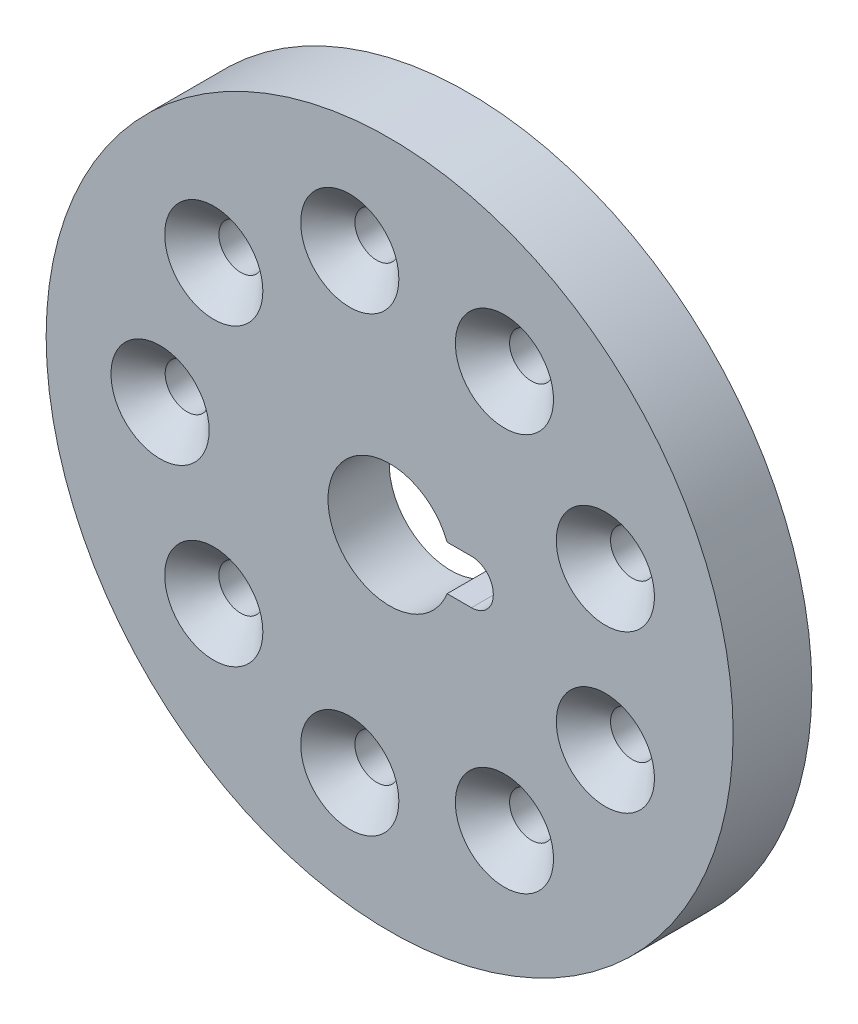
ISO-10303-21;
HEADER;
FILE_DESCRIPTION(('STEP AP214'),'2;1');
FILE_NAME('part.step','',(''),(''),'','','');
FILE_SCHEMA(('AUTOMOTIVE_DESIGN { 1 0 10303 214 1 1 1 1 }'));
ENDSEC;
DATA;
#1=APPLICATION_CONTEXT('core data for automotive mechanical design processes');
#2=APPLICATION_PROTOCOL_DEFINITION('international standard','automotive_design',2000,#1);
#3=PRODUCT_CONTEXT('',#1,'mechanical');
#4=PRODUCT('Part','Part','',(#3));
#5=PRODUCT_RELATED_PRODUCT_CATEGORY('part','',(#4));
#6=PRODUCT_DEFINITION_FORMATION('','',#4);
#7=PRODUCT_DEFINITION_CONTEXT('part definition',#1,'design');
#8=PRODUCT_DEFINITION('design','',#6,#7);
#9=PRODUCT_DEFINITION_SHAPE('','',#8);
#10=(LENGTH_UNIT() NAMED_UNIT(*) SI_UNIT(.MILLI.,.METRE.));
#11=(NAMED_UNIT(*) PLANE_ANGLE_UNIT() SI_UNIT($,.RADIAN.));
#12=(NAMED_UNIT(*) SI_UNIT($,.STERADIAN.) SOLID_ANGLE_UNIT());
#13=UNCERTAINTY_MEASURE_WITH_UNIT(LENGTH_MEASURE(1.E-05),#10,'distance_accuracy_value','');
#14=(GEOMETRIC_REPRESENTATION_CONTEXT(3) GLOBAL_UNCERTAINTY_ASSIGNED_CONTEXT((#13)) GLOBAL_UNIT_ASSIGNED_CONTEXT((#10,
#11,#12)) REPRESENTATION_CONTEXT('',''));
#15=CARTESIAN_POINT('',(0.,0.,0.));
#16=DIRECTION('',(0.,0.,1.));
#17=DIRECTION('',(1.,0.,0.));
#18=AXIS2_PLACEMENT_3D('',#15,#16,#17);
#19=CARTESIAN_POINT('',(-26.2463047854721,8.30206785474665E-11,5.9));
#20=DIRECTION('',(0.,0.,1.));
#21=DIRECTION('',(1.,0.,0.));
#22=AXIS2_PLACEMENT_3D('',#19,#20,#21);
#23=CONICAL_SURFACE('',#22,2.5125,0.785398163397448);
#24=CARTESIAN_POINT('',(-26.2463047854721,8.30206785474665E-11,5.9));
#25=DIRECTION('',(0.,0.,1.));
#26=DIRECTION('',(1.,0.,0.));
#27=AXIS2_PLACEMENT_3D('',#24,#25,#26);
#28=CIRCLE('',#27,2.5125);
#29=CARTESIAN_POINT('',(-23.7338047854721,8.30206785474665E-11,5.9));
#30=VERTEX_POINT('',#29);
#31=EDGE_CURVE('E301',#30,#30,#28,.T.);
#32=ORIENTED_EDGE('',*,*,#31,.F.);
#33=EDGE_LOOP('',(#32));
#34=FACE_BOUND('',#33,.T.);
#35=CARTESIAN_POINT('',(-26.2463047854721,8.30206785474665E-11,9.));
#36=DIRECTION('',(0.,0.,-1.));
#37=DIRECTION('',(1.,0.,0.));
#38=AXIS2_PLACEMENT_3D('',#35,#36,#37);
#39=CIRCLE('',#38,5.6125);
#40=CARTESIAN_POINT('',(-20.6338047854721,8.30206785474665E-11,9.));
#41=VERTEX_POINT('',#40);
#42=EDGE_CURVE('E250',#41,#41,#39,.T.);
#43=ORIENTED_EDGE('',*,*,#42,.F.);
#44=EDGE_LOOP('',(#43));
#45=FACE_BOUND('',#44,.T.);
#46=ADVANCED_FACE('F16',(#34,#45),#23,.F.);
#47=CARTESIAN_POINT('',(-20.1049714173453,-16.8731747541887,5.9));
#48=DIRECTION('',(0.,0.,1.));
#49=DIRECTION('',(1.,0.,0.));
#50=AXIS2_PLACEMENT_3D('',#47,#48,#49);
#51=CONICAL_SURFACE('',#50,2.5125,0.785398163397448);
#52=CARTESIAN_POINT('',(-20.1049714173453,-16.8731747541887,5.9));
#53=DIRECTION('',(0.,0.,1.));
#54=DIRECTION('',(1.,0.,0.));
#55=AXIS2_PLACEMENT_3D('',#52,#53,#54);
#56=CIRCLE('',#55,2.5125);
#57=CARTESIAN_POINT('',(-17.5924714173453,-16.8731747541887,5.9));
#58=VERTEX_POINT('',#57);
#59=EDGE_CURVE('E341',#58,#58,#56,.T.);
#60=ORIENTED_EDGE('',*,*,#59,.F.);
#61=EDGE_LOOP('',(#60));
#62=FACE_BOUND('',#61,.T.);
#63=CARTESIAN_POINT('',(-20.1049714173453,-16.8731747541887,9.));
#64=DIRECTION('',(0.,0.,-1.));
#65=DIRECTION('',(1.,0.,0.));
#66=AXIS2_PLACEMENT_3D('',#63,#64,#65);
#67=CIRCLE('',#66,5.6125);
#68=CARTESIAN_POINT('',(-14.4924714173453,-16.8731747541887,9.));
#69=VERTEX_POINT('',#68);
#70=EDGE_CURVE('E253',#69,#69,#67,.T.);
#71=ORIENTED_EDGE('',*,*,#70,.F.);
#72=EDGE_LOOP('',(#71));
#73=FACE_BOUND('',#72,.T.);
#74=ADVANCED_FACE('F390',(#62,#73),#51,.F.);
#75=CARTESIAN_POINT('',(-20.1049714173452,16.8731747543547,5.9));
#76=DIRECTION('',(0.,0.,1.));
#77=DIRECTION('',(1.,0.,0.));
#78=AXIS2_PLACEMENT_3D('',#75,#76,#77);
#79=CONICAL_SURFACE('',#78,2.5125,0.785398163397448);
#80=CARTESIAN_POINT('',(-20.1049714173452,16.8731747543547,5.9));
#81=DIRECTION('',(0.,0.,1.));
#82=DIRECTION('',(1.,0.,0.));
#83=AXIS2_PLACEMENT_3D('',#80,#81,#82);
#84=CIRCLE('',#83,2.5125);
#85=CARTESIAN_POINT('',(-17.5924714173452,16.8731747543547,5.9));
#86=VERTEX_POINT('',#85);
#87=EDGE_CURVE('E231',#86,#86,#84,.T.);
#88=ORIENTED_EDGE('',*,*,#87,.F.);
#89=EDGE_LOOP('',(#88));
#90=FACE_BOUND('',#89,.T.);
#91=CARTESIAN_POINT('',(-20.1049714173452,16.8731747543547,9.));
#92=DIRECTION('',(0.,0.,-1.));
#93=DIRECTION('',(1.,0.,0.));
#94=AXIS2_PLACEMENT_3D('',#91,#92,#93);
#95=CIRCLE('',#94,5.6125);
#96=CARTESIAN_POINT('',(-14.4924714173452,16.8731747543547,9.));
#97=VERTEX_POINT('',#96);
#98=EDGE_CURVE('E263',#97,#97,#95,.T.);
#99=ORIENTED_EDGE('',*,*,#98,.F.);
#100=EDGE_LOOP('',(#99));
#101=FACE_BOUND('',#100,.T.);
#102=ADVANCED_FACE('F395',(#90,#101),#79,.F.);
#103=CARTESIAN_POINT('',(-4.55456944922891,25.8512035166534,5.9));
#104=DIRECTION('',(0.,0.,1.));
#105=DIRECTION('',(1.,0.,0.));
#106=AXIS2_PLACEMENT_3D('',#103,#104,#105);
#107=CONICAL_SURFACE('',#106,2.5125,0.785398163397448);
#108=CARTESIAN_POINT('',(-4.55456944922891,25.8512035166534,5.9));
#109=DIRECTION('',(0.,0.,1.));
#110=DIRECTION('',(1.,0.,0.));
#111=AXIS2_PLACEMENT_3D('',#108,#109,#110);
#112=CIRCLE('',#111,2.5125);
#113=CARTESIAN_POINT('',(-2.04206944922891,25.8512035166534,5.9));
#114=VERTEX_POINT('',#113);
#115=EDGE_CURVE('E232',#114,#114,#112,.T.);
#116=ORIENTED_EDGE('',*,*,#115,.F.);
#117=EDGE_LOOP('',(#116));
#118=FACE_BOUND('',#117,.T.);
#119=CARTESIAN_POINT('',(-4.55456944922891,25.8512035166534,9.));
#120=DIRECTION('',(0.,0.,-1.));
#121=DIRECTION('',(1.,0.,0.));
#122=AXIS2_PLACEMENT_3D('',#119,#120,#121);
#123=CIRCLE('',#122,5.6125);
#124=CARTESIAN_POINT('',(1.05793055077109,25.8512035166534,9.));
#125=VERTEX_POINT('',#124);
#126=EDGE_CURVE('E259',#125,#125,#123,.T.);
#127=ORIENTED_EDGE('',*,*,#126,.F.);
#128=EDGE_LOOP('',(#127));
#129=FACE_BOUND('',#128,.T.);
#130=ADVANCED_FACE('F548',(#118,#129),#107,.F.);
#131=CARTESIAN_POINT('',(24.6706265101581,8.97802876238172,5.9));
#132=DIRECTION('',(0.,0.,1.));
#133=DIRECTION('',(1.,0.,0.));
#134=AXIS2_PLACEMENT_3D('',#131,#132,#133);
#135=CONICAL_SURFACE('',#134,2.5125,0.785398163397448);
#136=CARTESIAN_POINT('',(24.6706265101581,8.97802876238172,5.9));
#137=DIRECTION('',(0.,0.,1.));
#138=DIRECTION('',(1.,0.,0.));
#139=AXIS2_PLACEMENT_3D('',#136,#137,#138);
#140=CIRCLE('',#139,2.5125);
#141=CARTESIAN_POINT('',(27.1831265101581,8.97802876238172,5.9));
#142=VERTEX_POINT('',#141);
#143=EDGE_CURVE('E202',#142,#142,#140,.T.);
#144=ORIENTED_EDGE('',*,*,#143,.F.);
#145=EDGE_LOOP('',(#144));
#146=FACE_BOUND('',#145,.T.);
#147=CARTESIAN_POINT('',(24.6706265101581,8.97802876238172,9.));
#148=DIRECTION('',(0.,0.,-1.));
#149=DIRECTION('',(1.,0.,0.));
#150=AXIS2_PLACEMENT_3D('',#147,#148,#149);
#151=CIRCLE('',#150,5.6125);
#152=CARTESIAN_POINT('',(30.2831265101581,8.97802876238172,9.));
#153=VERTEX_POINT('',#152);
#154=EDGE_CURVE('E262',#153,#153,#151,.T.);
#155=ORIENTED_EDGE('',*,*,#154,.F.);
#156=EDGE_LOOP('',(#155));
#157=FACE_BOUND('',#156,.T.);
#158=ADVANCED_FACE('F625',(#146,#157),#135,.F.);
#159=CARTESIAN_POINT('',(13.1286952145279,-22.7331668492586,5.9));
#160=DIRECTION('',(0.,0.,1.));
#161=DIRECTION('',(1.,0.,0.));
#162=AXIS2_PLACEMENT_3D('',#159,#160,#161);
#163=CONICAL_SURFACE('',#162,2.5125,0.785398163397448);
#164=CARTESIAN_POINT('',(13.1286952145279,-22.7331668492586,5.9));
#165=DIRECTION('',(0.,0.,1.));
#166=DIRECTION('',(1.,0.,0.));
#167=AXIS2_PLACEMENT_3D('',#164,#165,#166);
#168=CIRCLE('',#167,2.5125);
#169=CARTESIAN_POINT('',(15.6411952145279,-22.7331668492586,5.9));
#170=VERTEX_POINT('',#169);
#171=EDGE_CURVE('E338',#170,#170,#168,.T.);
#172=ORIENTED_EDGE('',*,*,#171,.F.);
#173=EDGE_LOOP('',(#172));
#174=FACE_BOUND('',#173,.T.);
#175=CARTESIAN_POINT('',(13.1286952145279,-22.7331668492586,9.));
#176=DIRECTION('',(0.,0.,-1.));
#177=DIRECTION('',(1.,0.,0.));
#178=AXIS2_PLACEMENT_3D('',#175,#176,#177);
#179=CIRCLE('',#178,5.6125);
#180=CARTESIAN_POINT('',(18.7411952145279,-22.7331668492586,9.));
#181=VERTEX_POINT('',#180);
#182=EDGE_CURVE('E240',#181,#181,#179,.T.);
#183=ORIENTED_EDGE('',*,*,#182,.F.);
#184=EDGE_LOOP('',(#183));
#185=FACE_BOUND('',#184,.T.);
#186=ADVANCED_FACE('F621',(#174,#185),#163,.F.);
#187=CARTESIAN_POINT('',(-4.55456944922904,-25.8512035164876,5.9));
#188=DIRECTION('',(0.,0.,1.));
#189=DIRECTION('',(1.,0.,0.));
#190=AXIS2_PLACEMENT_3D('',#187,#188,#189);
#191=CONICAL_SURFACE('',#190,2.5125,0.785398163397448);
#192=CARTESIAN_POINT('',(-4.55456944922904,-25.8512035164876,5.9));
#193=DIRECTION('',(0.,0.,1.));
#194=DIRECTION('',(1.,0.,0.));
#195=AXIS2_PLACEMENT_3D('',#192,#193,#194);
#196=CIRCLE('',#195,2.5125);
#197=CARTESIAN_POINT('',(-2.04206944922904,-25.8512035164876,5.9));
#198=VERTEX_POINT('',#197);
#199=EDGE_CURVE('E328',#198,#198,#196,.T.);
#200=ORIENTED_EDGE('',*,*,#199,.F.);
#201=EDGE_LOOP('',(#200));
#202=FACE_BOUND('',#201,.T.);
#203=CARTESIAN_POINT('',(-4.55456944922904,-25.8512035164876,9.));
#204=DIRECTION('',(0.,0.,-1.));
#205=DIRECTION('',(1.,0.,0.));
#206=AXIS2_PLACEMENT_3D('',#203,#204,#205);
#207=CIRCLE('',#206,5.6125);
#208=CARTESIAN_POINT('',(1.05793055077096,-25.8512035164876,9.));
#209=VERTEX_POINT('',#208);
#210=EDGE_CURVE('E236',#209,#209,#207,.T.);
#211=ORIENTED_EDGE('',*,*,#210,.F.);
#212=EDGE_LOOP('',(#211));
#213=FACE_BOUND('',#212,.T.);
#214=ADVANCED_FACE('F430',(#202,#213),#191,.F.);
#215=CARTESIAN_POINT('',(24.6706265101581,-8.97802876221591,5.9));
#216=DIRECTION('',(0.,0.,1.));
#217=DIRECTION('',(1.,0.,0.));
#218=AXIS2_PLACEMENT_3D('',#215,#216,#217);
#219=CONICAL_SURFACE('',#218,2.5125,0.785398163397448);
#220=CARTESIAN_POINT('',(24.6706265101581,-8.97802876221591,5.9));
#221=DIRECTION('',(0.,0.,1.));
#222=DIRECTION('',(1.,0.,0.));
#223=AXIS2_PLACEMENT_3D('',#220,#221,#222);
#224=CIRCLE('',#223,2.5125);
#225=CARTESIAN_POINT('',(27.1831265101581,-8.97802876221591,5.9));
#226=VERTEX_POINT('',#225);
#227=EDGE_CURVE('E203',#226,#226,#224,.T.);
#228=ORIENTED_EDGE('',*,*,#227,.F.);
#229=EDGE_LOOP('',(#228));
#230=FACE_BOUND('',#229,.T.);
#231=CARTESIAN_POINT('',(24.6706265101581,-8.97802876221591,9.));
#232=DIRECTION('',(0.,0.,-1.));
#233=DIRECTION('',(1.,0.,0.));
#234=AXIS2_PLACEMENT_3D('',#231,#232,#233);
#235=CIRCLE('',#234,5.6125);
#236=CARTESIAN_POINT('',(30.2831265101581,-8.97802876221591,9.));
#237=VERTEX_POINT('',#236);
#238=EDGE_CURVE('E239',#237,#237,#235,.T.);
#239=ORIENTED_EDGE('',*,*,#238,.F.);
#240=EDGE_LOOP('',(#239));
#241=FACE_BOUND('',#240,.T.);
#242=ADVANCED_FACE('F427',(#230,#241),#219,.F.);
#243=CARTESIAN_POINT('',(13.128695214528,22.7331668494245,5.9));
#244=DIRECTION('',(0.,0.,1.));
#245=DIRECTION('',(1.,0.,0.));
#246=AXIS2_PLACEMENT_3D('',#243,#244,#245);
#247=CONICAL_SURFACE('',#246,2.5125,0.785398163397448);
#248=CARTESIAN_POINT('',(13.128695214528,22.7331668494245,5.9));
#249=DIRECTION('',(0.,0.,1.));
#250=DIRECTION('',(1.,0.,0.));
#251=AXIS2_PLACEMENT_3D('',#248,#249,#250);
#252=CIRCLE('',#251,2.5125);
#253=CARTESIAN_POINT('',(15.641195214528,22.7331668494245,5.9));
#254=VERTEX_POINT('',#253);
#255=EDGE_CURVE('E246',#254,#254,#252,.T.);
#256=ORIENTED_EDGE('',*,*,#255,.F.);
#257=EDGE_LOOP('',(#256));
#258=FACE_BOUND('',#257,.T.);
#259=CARTESIAN_POINT('',(13.128695214528,22.7331668494245,9.));
#260=DIRECTION('',(0.,0.,-1.));
#261=DIRECTION('',(1.,0.,0.));
#262=AXIS2_PLACEMENT_3D('',#259,#260,#261);
#263=CIRCLE('',#262,5.6125);
#264=CARTESIAN_POINT('',(18.741195214528,22.7331668494245,9.));
#265=VERTEX_POINT('',#264);
#266=EDGE_CURVE('E326',#265,#265,#263,.T.);
#267=ORIENTED_EDGE('',*,*,#266,.F.);
#268=EDGE_LOOP('',(#267));
#269=FACE_BOUND('',#268,.T.);
#270=ADVANCED_FACE('F385',(#258,#269),#247,.F.);
#271=CARTESIAN_POINT('',(0.00369521452794896,8.29614155151148E-11,2.));
#272=DIRECTION('',(0.,0.,1.));
#273=DIRECTION('',(1.,0.,0.));
#274=AXIS2_PLACEMENT_3D('',#271,#272,#273);
#275=PLANE('',#274);
#276=CARTESIAN_POINT('',(0.00369521452792121,8.30243805016595E-11,2.));
#277=DIRECTION('',(0.,0.,1.));
#278=DIRECTION('',(1.,0.,0.));
#279=AXIS2_PLACEMENT_3D('',#276,#277,#278);
#280=CIRCLE('',#279,32.56);
#281=CARTESIAN_POINT('',(32.5636952145279,8.30243805016595E-11,2.));
#282=VERTEX_POINT('',#281);
#283=EDGE_CURVE('E11',#282,#282,#280,.T.);
#284=ORIENTED_EDGE('',*,*,#283,.F.);
#285=EDGE_LOOP('',(#284));
#286=FACE_BOUND('',#285,.T.);
#287=CARTESIAN_POINT('',(-26.2463047854721,8.30206785474665E-11,2.));
#288=DIRECTION('',(0.,0.,1.));
#289=DIRECTION('',(1.,0.,0.));
#290=AXIS2_PLACEMENT_3D('',#287,#288,#289);
#291=CIRCLE('',#290,2.5125);
#292=CARTESIAN_POINT('',(-23.7338047854721,8.30206785474665E-11,2.));
#293=VERTEX_POINT('',#292);
#294=EDGE_CURVE('E235',#293,#293,#291,.T.);
#295=ORIENTED_EDGE('',*,*,#294,.T.);
#296=EDGE_LOOP('',(#295));
#297=FACE_BOUND('',#296,.T.);
#298=CARTESIAN_POINT('',(-20.1049714173453,-16.8731747541887,2.));
#299=DIRECTION('',(0.,0.,1.));
#300=DIRECTION('',(1.,0.,0.));
#301=AXIS2_PLACEMENT_3D('',#298,#299,#300);
#302=CIRCLE('',#301,2.5125);
#303=CARTESIAN_POINT('',(-17.5924714173453,-16.8731747541887,2.));
#304=VERTEX_POINT('',#303);
#305=EDGE_CURVE('E348',#304,#304,#302,.T.);
#306=ORIENTED_EDGE('',*,*,#305,.T.);
#307=EDGE_LOOP('',(#306));
#308=FACE_BOUND('',#307,.T.);
#309=CARTESIAN_POINT('',(-4.55456944922904,-25.8512035164876,2.));
#310=DIRECTION('',(0.,0.,1.));
#311=DIRECTION('',(1.,0.,0.));
#312=AXIS2_PLACEMENT_3D('',#309,#310,#311);
#313=CIRCLE('',#312,2.5125);
#314=CARTESIAN_POINT('',(-2.04206944922904,-25.8512035164876,2.));
#315=VERTEX_POINT('',#314);
#316=EDGE_CURVE('E331',#315,#315,#313,.T.);
#317=ORIENTED_EDGE('',*,*,#316,.T.);
#318=EDGE_LOOP('',(#317));
#319=FACE_BOUND('',#318,.T.);
#320=CARTESIAN_POINT('',(13.1286952145279,-22.7331668492586,2.));
#321=DIRECTION('',(0.,0.,1.));
#322=DIRECTION('',(1.,0.,0.));
#323=AXIS2_PLACEMENT_3D('',#320,#321,#322);
#324=CIRCLE('',#323,2.5125);
#325=CARTESIAN_POINT('',(15.6411952145279,-22.7331668492586,2.));
#326=VERTEX_POINT('',#325);
#327=EDGE_CURVE('E330',#326,#326,#324,.T.);
#328=ORIENTED_EDGE('',*,*,#327,.T.);
#329=EDGE_LOOP('',(#328));
#330=FACE_BOUND('',#329,.T.);
#331=CARTESIAN_POINT('',(24.6706265101581,-8.97802876221591,2.));
#332=DIRECTION('',(0.,0.,1.));
#333=DIRECTION('',(1.,0.,0.));
#334=AXIS2_PLACEMENT_3D('',#331,#332,#333);
#335=CIRCLE('',#334,2.5125);
#336=CARTESIAN_POINT('',(27.1831265101581,-8.97802876221591,2.));
#337=VERTEX_POINT('',#336);
#338=EDGE_CURVE('E212',#337,#337,#335,.T.);
#339=ORIENTED_EDGE('',*,*,#338,.T.);
#340=EDGE_LOOP('',(#339));
#341=FACE_BOUND('',#340,.T.);
#342=CARTESIAN_POINT('',(24.6706265101581,8.97802876238172,2.));
#343=DIRECTION('',(0.,0.,1.));
#344=DIRECTION('',(1.,0.,0.));
#345=AXIS2_PLACEMENT_3D('',#342,#343,#344);
#346=CIRCLE('',#345,2.5125);
#347=CARTESIAN_POINT('',(27.1831265101581,8.97802876238172,2.));
#348=VERTEX_POINT('',#347);
#349=EDGE_CURVE('E197',#348,#348,#346,.T.);
#350=ORIENTED_EDGE('',*,*,#349,.T.);
#351=EDGE_LOOP('',(#350));
#352=FACE_BOUND('',#351,.T.);
#353=CARTESIAN_POINT('',(13.128695214528,22.7331668494245,2.));
#354=DIRECTION('',(0.,0.,1.));
#355=DIRECTION('',(1.,0.,0.));
#356=AXIS2_PLACEMENT_3D('',#353,#354,#355);
#357=CIRCLE('',#356,2.5125);
#358=CARTESIAN_POINT('',(15.641195214528,22.7331668494245,2.));
#359=VERTEX_POINT('',#358);
#360=EDGE_CURVE('E210',#359,#359,#357,.T.);
#361=ORIENTED_EDGE('',*,*,#360,.T.);
#362=EDGE_LOOP('',(#361));
#363=FACE_BOUND('',#362,.T.);
#364=CARTESIAN_POINT('',(-4.55456944922891,25.8512035166534,2.));
#365=DIRECTION('',(0.,0.,1.));
#366=DIRECTION('',(1.,0.,0.));
#367=AXIS2_PLACEMENT_3D('',#364,#365,#366);
#368=CIRCLE('',#367,2.5125);
#369=CARTESIAN_POINT('',(-2.04206944922891,25.8512035166534,2.));
#370=VERTEX_POINT('',#369);
#371=EDGE_CURVE('E249',#370,#370,#368,.T.);
#372=ORIENTED_EDGE('',*,*,#371,.T.);
#373=EDGE_LOOP('',(#372));
#374=FACE_BOUND('',#373,.T.);
#375=CARTESIAN_POINT('',(-20.1049714173452,16.8731747543547,2.));
#376=DIRECTION('',(0.,0.,1.));
#377=DIRECTION('',(1.,0.,0.));
#378=AXIS2_PLACEMENT_3D('',#375,#376,#377);
#379=CIRCLE('',#378,2.5125);
#380=CARTESIAN_POINT('',(-17.5924714173452,16.8731747543547,2.));
#381=VERTEX_POINT('',#380);
#382=EDGE_CURVE('E229',#381,#381,#379,.T.);
#383=ORIENTED_EDGE('',*,*,#382,.T.);
#384=EDGE_LOOP('',(#383));
#385=FACE_BOUND('',#384,.T.);
#386=CARTESIAN_POINT('',(0.0036952145279082,8.30179963447561E-11,2.));
#387=DIRECTION('',(0.,0.,1.));
#388=DIRECTION('',(1.,0.,0.));
#389=AXIS2_PLACEMENT_3D('',#386,#387,#388);
#390=CIRCLE('',#389,7.05);
#391=CARTESIAN_POINT('',(6.57636590458992,2.55000000008302,2.));
#392=VERTEX_POINT('',#391);
#393=CARTESIAN_POINT('',(6.57636590458992,-2.54999999991697,2.));
#394=VERTEX_POINT('',#393);
#395=EDGE_CURVE('E291',#392,#394,#390,.T.);
#396=ORIENTED_EDGE('',*,*,#395,.T.);
#397=DIRECTION('',(-1.,0.,0.));
#398=VECTOR('',#397,1.);
#399=CARTESIAN_POINT('',(7.96503055955892,-2.54999999991697,2.));
#400=LINE('',#399,#398);
#401=CARTESIAN_POINT('',(9.35369521452792,-2.54999999991697,2.));
#402=VERTEX_POINT('',#401);
#403=EDGE_CURVE('E245',#402,#394,#400,.T.);
#404=ORIENTED_EDGE('',*,*,#403,.F.);
#405=CARTESIAN_POINT('',(9.35369521452792,-0.0499999999169749,2.));
#406=DIRECTION('',(0.,0.,1.));
#407=DIRECTION('',(1.,0.,0.));
#408=AXIS2_PLACEMENT_3D('',#405,#406,#407);
#409=CIRCLE('',#408,2.5);
#410=CARTESIAN_POINT('',(11.8536952145279,-0.0499999999169749,2.));
#411=VERTEX_POINT('',#410);
#412=EDGE_CURVE('E223',#402,#411,#409,.T.);
#413=ORIENTED_EDGE('',*,*,#412,.T.);
#414=DIRECTION('',(0.,1.,0.));
#415=VECTOR('',#414,1.);
#416=CARTESIAN_POINT('',(11.8536952145279,8.30218665624945E-11,2.));
#417=LINE('',#416,#415);
#418=CARTESIAN_POINT('',(11.8536952145279,0.0500000000830178,2.));
#419=VERTEX_POINT('',#418);
#420=EDGE_CURVE('E272',#411,#419,#417,.T.);
#421=ORIENTED_EDGE('',*,*,#420,.T.);
#422=CARTESIAN_POINT('',(9.35369521452792,0.0500000000830179,2.));
#423=DIRECTION('',(0.,0.,1.));
#424=DIRECTION('',(1.,0.,0.));
#425=AXIS2_PLACEMENT_3D('',#422,#423,#424);
#426=CIRCLE('',#425,2.5);
#427=CARTESIAN_POINT('',(9.35369521452792,2.55000000008302,2.));
#428=VERTEX_POINT('',#427);
#429=EDGE_CURVE('E216',#419,#428,#426,.T.);
#430=ORIENTED_EDGE('',*,*,#429,.T.);
#431=DIRECTION('',(-1.,0.,0.));
#432=VECTOR('',#431,1.);
#433=CARTESIAN_POINT('',(7.96503055955892,2.55000000008302,2.));
#434=LINE('',#433,#432);
#435=EDGE_CURVE('E295',#428,#392,#434,.T.);
#436=ORIENTED_EDGE('',*,*,#435,.T.);
#437=EDGE_LOOP('',(#396,#404,#413,#421,#430,#436));
#438=FACE_BOUND('',#437,.T.);
#439=ADVANCED_FACE('F198',(#286,#297,#308,#319,#330,#341,#352,#363,#374,#385,#438),#275,.F.);
#440=CARTESIAN_POINT('',(0.00369521452792121,8.30243805016595E-11,2.));
#441=DIRECTION('',(0.,0.,-1.));
#442=DIRECTION('',(-1.,0.,0.));
#443=AXIS2_PLACEMENT_3D('',#440,#441,#442);
#444=CYLINDRICAL_SURFACE('',#443,32.56);
#445=CARTESIAN_POINT('',(0.00369521452792121,8.30243805016595E-11,0.));
#446=DIRECTION('',(0.,0.,1.));
#447=DIRECTION('',(1.,0.,0.));
#448=AXIS2_PLACEMENT_3D('',#445,#446,#447);
#449=CIRCLE('',#448,32.56);
#450=CARTESIAN_POINT('',(32.5636952145279,8.30243805016595E-11,0.));
#451=VERTEX_POINT('',#450);
#452=EDGE_CURVE('E26',#451,#451,#449,.T.);
#453=ORIENTED_EDGE('',*,*,#452,.F.);
#454=EDGE_LOOP('',(#453));
#455=FACE_BOUND('',#454,.T.);
#456=ORIENTED_EDGE('',*,*,#283,.T.);
#457=EDGE_LOOP('',(#456));
#458=FACE_BOUND('',#457,.T.);
#459=ADVANCED_FACE('F376',(#455,#458),#444,.F.);
#460=CARTESIAN_POINT('',(0.00369521452794896,8.29614155151148E-11,0.));
#461=DIRECTION('',(0.,0.,1.));
#462=DIRECTION('',(1.,0.,0.));
#463=AXIS2_PLACEMENT_3D('',#460,#461,#462);
#464=PLANE('',#463);
#465=CARTESIAN_POINT('',(0.00369521452794896,8.29593232341445E-11,0.));
#466=DIRECTION('',(0.,0.,1.));
#467=DIRECTION('',(1.,0.,0.));
#468=AXIS2_PLACEMENT_3D('',#465,#466,#467);
#469=CIRCLE('',#468,39.2755005);
#470=CARTESIAN_POINT('',(39.2791957145279,8.29593232341445E-11,0.));
#471=VERTEX_POINT('',#470);
#472=EDGE_CURVE('E254',#471,#471,#469,.T.);
#473=ORIENTED_EDGE('',*,*,#472,.F.);
#474=EDGE_LOOP('',(#473));
#475=FACE_BOUND('',#474,.T.);
#476=ORIENTED_EDGE('',*,*,#452,.T.);
#477=EDGE_LOOP('',(#476));
#478=FACE_BOUND('',#477,.T.);
#479=ADVANCED_FACE('F372',(#475,#478),#464,.F.);
#480=CARTESIAN_POINT('',(0.00369521452794896,8.29614155151148E-11,9.));
#481=DIRECTION('',(0.,0.,1.));
#482=DIRECTION('',(1.,0.,0.));
#483=AXIS2_PLACEMENT_3D('',#480,#481,#482);
#484=PLANE('',#483);
#485=CARTESIAN_POINT('',(0.0036952145279082,8.30179963447561E-11,9.));
#486=DIRECTION('',(0.,0.,1.));
#487=DIRECTION('',(1.,0.,0.));
#488=AXIS2_PLACEMENT_3D('',#485,#486,#487);
#489=CIRCLE('',#488,7.05);
#490=CARTESIAN_POINT('',(6.57636590458992,2.55000000008302,9.));
#491=VERTEX_POINT('',#490);
#492=CARTESIAN_POINT('',(6.57636590458992,-2.54999999991697,9.));
#493=VERTEX_POINT('',#492);
#494=EDGE_CURVE('E293',#491,#493,#489,.T.);
#495=ORIENTED_EDGE('',*,*,#494,.F.);
#496=DIRECTION('',(-1.,0.,0.));
#497=VECTOR('',#496,1.);
#498=CARTESIAN_POINT('',(7.96503055955892,2.55000000008302,9.));
#499=LINE('',#498,#497);
#500=CARTESIAN_POINT('',(9.35369521452792,2.55000000008302,9.));
#501=VERTEX_POINT('',#500);
#502=EDGE_CURVE('E316',#501,#491,#499,.T.);
#503=ORIENTED_EDGE('',*,*,#502,.F.);
#504=CARTESIAN_POINT('',(9.35369521452792,0.0500000000830179,9.));
#505=DIRECTION('',(0.,0.,1.));
#506=DIRECTION('',(1.,0.,0.));
#507=AXIS2_PLACEMENT_3D('',#504,#505,#506);
#508=CIRCLE('',#507,2.5);
#509=CARTESIAN_POINT('',(11.8536952145279,0.0500000000830178,9.));
#510=VERTEX_POINT('',#509);
#511=EDGE_CURVE('E222',#510,#501,#508,.T.);
#512=ORIENTED_EDGE('',*,*,#511,.F.);
#513=DIRECTION('',(0.,1.,0.));
#514=VECTOR('',#513,1.);
#515=CARTESIAN_POINT('',(11.8536952145279,8.30218665624945E-11,9.));
#516=LINE('',#515,#514);
#517=CARTESIAN_POINT('',(11.8536952145279,-0.0499999999169749,9.));
#518=VERTEX_POINT('',#517);
#519=EDGE_CURVE('E228',#518,#510,#516,.T.);
#520=ORIENTED_EDGE('',*,*,#519,.F.);
#521=CARTESIAN_POINT('',(9.35369521452792,-0.0499999999169749,9.));
#522=DIRECTION('',(0.,0.,1.));
#523=DIRECTION('',(1.,0.,0.));
#524=AXIS2_PLACEMENT_3D('',#521,#522,#523);
#525=CIRCLE('',#524,2.5);
#526=CARTESIAN_POINT('',(9.35369521452792,-2.54999999991697,9.));
#527=VERTEX_POINT('',#526);
#528=EDGE_CURVE('E258',#527,#518,#525,.T.);
#529=ORIENTED_EDGE('',*,*,#528,.F.);
#530=DIRECTION('',(-1.,0.,0.));
#531=VECTOR('',#530,1.);
#532=CARTESIAN_POINT('',(7.96503055955892,-2.54999999991697,9.));
#533=LINE('',#532,#531);
#534=EDGE_CURVE('E241',#527,#493,#533,.T.);
#535=ORIENTED_EDGE('',*,*,#534,.T.);
#536=EDGE_LOOP('',(#495,#503,#512,#520,#529,#535));
#537=FACE_BOUND('',#536,.T.);
#538=CARTESIAN_POINT('',(0.00369521452794896,8.29593232341445E-11,9.));
#539=DIRECTION('',(0.,0.,1.));
#540=DIRECTION('',(1.,0.,0.));
#541=AXIS2_PLACEMENT_3D('',#538,#539,#540);
#542=CIRCLE('',#541,39.2755005);
#543=CARTESIAN_POINT('',(39.2791957145279,8.29593232341445E-11,9.));
#544=VERTEX_POINT('',#543);
#545=EDGE_CURVE('E244',#544,#544,#542,.T.);
#546=ORIENTED_EDGE('',*,*,#545,.T.);
#547=EDGE_LOOP('',(#546));
#548=FACE_BOUND('',#547,.T.);
#549=ORIENTED_EDGE('',*,*,#266,.T.);
#550=EDGE_LOOP('',(#549));
#551=FACE_BOUND('',#550,.T.);
#552=ORIENTED_EDGE('',*,*,#238,.T.);
#553=EDGE_LOOP('',(#552));
#554=FACE_BOUND('',#553,.T.);
#555=ORIENTED_EDGE('',*,*,#210,.T.);
#556=EDGE_LOOP('',(#555));
#557=FACE_BOUND('',#556,.T.);
#558=ORIENTED_EDGE('',*,*,#182,.T.);
#559=EDGE_LOOP('',(#558));
#560=FACE_BOUND('',#559,.T.);
#561=ORIENTED_EDGE('',*,*,#154,.T.);
#562=EDGE_LOOP('',(#561));
#563=FACE_BOUND('',#562,.T.);
#564=ORIENTED_EDGE('',*,*,#126,.T.);
#565=EDGE_LOOP('',(#564));
#566=FACE_BOUND('',#565,.T.);
#567=ORIENTED_EDGE('',*,*,#98,.T.);
#568=EDGE_LOOP('',(#567));
#569=FACE_BOUND('',#568,.T.);
#570=ORIENTED_EDGE('',*,*,#70,.T.);
#571=EDGE_LOOP('',(#570));
#572=FACE_BOUND('',#571,.T.);
#573=ORIENTED_EDGE('',*,*,#42,.T.);
#574=EDGE_LOOP('',(#573));
#575=FACE_BOUND('',#574,.T.);
#576=ADVANCED_FACE('F375',(#537,#548,#551,#554,#557,#560,#563,#566,#569,#572,#575),#484,.T.);
#577=CARTESIAN_POINT('',(0.00369521452794896,8.29593232341445E-11,9.));
#578=DIRECTION('',(0.,0.,-1.));
#579=DIRECTION('',(-1.,0.,0.));
#580=AXIS2_PLACEMENT_3D('',#577,#578,#579);
#581=CYLINDRICAL_SURFACE('',#580,39.2755005);
#582=ORIENTED_EDGE('',*,*,#472,.T.);
#583=EDGE_LOOP('',(#582));
#584=FACE_BOUND('',#583,.T.);
#585=ORIENTED_EDGE('',*,*,#545,.F.);
#586=EDGE_LOOP('',(#585));
#587=FACE_BOUND('',#586,.T.);
#588=ADVANCED_FACE('F369',(#584,#587),#581,.T.);
#589=CARTESIAN_POINT('',(7.96503055955892,-2.54999999991697,9.));
#590=DIRECTION('',(0.,-1.,0.));
#591=DIRECTION('',(0.,0.,-1.));
#592=AXIS2_PLACEMENT_3D('',#589,#590,#591);
#593=PLANE('',#592);
#594=DIRECTION('',(0.,0.,-1.));
#595=VECTOR('',#594,1.);
#596=CARTESIAN_POINT('',(9.35369521452792,-2.54999999991697,9.));
#597=LINE('',#596,#595);
#598=EDGE_CURVE('E227',#527,#402,#597,.T.);
#599=ORIENTED_EDGE('',*,*,#598,.T.);
#600=ORIENTED_EDGE('',*,*,#403,.T.);
#601=DIRECTION('',(0.,0.,-1.));
#602=VECTOR('',#601,1.);
#603=CARTESIAN_POINT('',(6.57636590458992,-2.54999999991697,9.));
#604=LINE('',#603,#602);
#605=EDGE_CURVE('E281',#493,#394,#604,.T.);
#606=ORIENTED_EDGE('',*,*,#605,.F.);
#607=ORIENTED_EDGE('',*,*,#534,.F.);
#608=EDGE_LOOP('',(#599,#600,#606,#607));
#609=FACE_BOUND('',#608,.T.);
#610=ADVANCED_FACE('F280',(#609),#593,.F.);
#611=CARTESIAN_POINT('',(9.35369521452792,-0.0499999999169749,9.));
#612=DIRECTION('',(0.,0.,-1.));
#613=DIRECTION('',(-1.,0.,0.));
#614=AXIS2_PLACEMENT_3D('',#611,#612,#613);
#615=CYLINDRICAL_SURFACE('',#614,2.5);
#616=ORIENTED_EDGE('',*,*,#412,.F.);
#617=ORIENTED_EDGE('',*,*,#598,.F.);
#618=ORIENTED_EDGE('',*,*,#528,.T.);
#619=DIRECTION('',(0.,0.,-1.));
#620=VECTOR('',#619,1.);
#621=CARTESIAN_POINT('',(11.8536952145279,-0.0499999999169749,9.));
#622=LINE('',#621,#620);
#623=EDGE_CURVE('E268',#518,#411,#622,.T.);
#624=ORIENTED_EDGE('',*,*,#623,.T.);
#625=EDGE_LOOP('',(#616,#617,#618,#624));
#626=FACE_BOUND('',#625,.T.);
#627=ADVANCED_FACE('F423',(#626),#615,.F.);
#628=CARTESIAN_POINT('',(11.8536952145279,8.30218665624945E-11,9.));
#629=DIRECTION('',(-1.,0.,0.));
#630=DIRECTION('',(0.,0.,1.));
#631=AXIS2_PLACEMENT_3D('',#628,#629,#630);
#632=PLANE('',#631);
#633=ORIENTED_EDGE('',*,*,#420,.F.);
#634=ORIENTED_EDGE('',*,*,#623,.F.);
#635=ORIENTED_EDGE('',*,*,#519,.T.);
#636=DIRECTION('',(0.,0.,-1.));
#637=VECTOR('',#636,1.);
#638=CARTESIAN_POINT('',(11.8536952145279,0.0500000000830178,9.));
#639=LINE('',#638,#637);
#640=EDGE_CURVE('E218',#510,#419,#639,.T.);
#641=ORIENTED_EDGE('',*,*,#640,.T.);
#642=EDGE_LOOP('',(#633,#634,#635,#641));
#643=FACE_BOUND('',#642,.T.);
#644=ADVANCED_FACE('F416',(#643),#632,.T.);
#645=CARTESIAN_POINT('',(9.35369521452792,0.0500000000830179,9.));
#646=DIRECTION('',(0.,0.,-1.));
#647=DIRECTION('',(-1.,0.,0.));
#648=AXIS2_PLACEMENT_3D('',#645,#646,#647);
#649=CYLINDRICAL_SURFACE('',#648,2.5);
#650=ORIENTED_EDGE('',*,*,#429,.F.);
#651=ORIENTED_EDGE('',*,*,#640,.F.);
#652=ORIENTED_EDGE('',*,*,#511,.T.);
#653=DIRECTION('',(0.,0.,-1.));
#654=VECTOR('',#653,1.);
#655=CARTESIAN_POINT('',(9.35369521452792,2.55000000008302,9.));
#656=LINE('',#655,#654);
#657=EDGE_CURVE('E315',#501,#428,#656,.T.);
#658=ORIENTED_EDGE('',*,*,#657,.T.);
#659=EDGE_LOOP('',(#650,#651,#652,#658));
#660=FACE_BOUND('',#659,.T.);
#661=ADVANCED_FACE('F413',(#660),#649,.F.);
#662=CARTESIAN_POINT('',(7.96503055955892,2.55000000008302,9.));
#663=DIRECTION('',(0.,-1.,0.));
#664=DIRECTION('',(0.,0.,-1.));
#665=AXIS2_PLACEMENT_3D('',#662,#663,#664);
#666=PLANE('',#665);
#667=ORIENTED_EDGE('',*,*,#435,.F.);
#668=ORIENTED_EDGE('',*,*,#657,.F.);
#669=ORIENTED_EDGE('',*,*,#502,.T.);
#670=DIRECTION('',(0.,0.,-1.));
#671=VECTOR('',#670,1.);
#672=CARTESIAN_POINT('',(6.57636590458992,2.55000000008302,9.));
#673=LINE('',#672,#671);
#674=EDGE_CURVE('E300',#491,#392,#673,.T.);
#675=ORIENTED_EDGE('',*,*,#674,.T.);
#676=EDGE_LOOP('',(#667,#668,#669,#675));
#677=FACE_BOUND('',#676,.T.);
#678=ADVANCED_FACE('F406',(#677),#666,.T.);
#679=CARTESIAN_POINT('',(0.0036952145279082,8.30179963447561E-11,9.));
#680=DIRECTION('',(0.,0.,-1.));
#681=DIRECTION('',(-1.,0.,0.));
#682=AXIS2_PLACEMENT_3D('',#679,#680,#681);
#683=CYLINDRICAL_SURFACE('',#682,7.05);
#684=ORIENTED_EDGE('',*,*,#395,.F.);
#685=ORIENTED_EDGE('',*,*,#674,.F.);
#686=ORIENTED_EDGE('',*,*,#494,.T.);
#687=ORIENTED_EDGE('',*,*,#605,.T.);
#688=EDGE_LOOP('',(#684,#685,#686,#687));
#689=FACE_BOUND('',#688,.T.);
#690=ADVANCED_FACE('F289',(#689),#683,.F.);
#691=CARTESIAN_POINT('',(-26.2463047854721,8.30206785474665E-11,9.));
#692=DIRECTION('',(0.,0.,-1.));
#693=DIRECTION('',(-1.,0.,0.));
#694=AXIS2_PLACEMENT_3D('',#691,#692,#693);
#695=CYLINDRICAL_SURFACE('',#694,2.5125);
#696=ORIENTED_EDGE('',*,*,#31,.T.);
#697=EDGE_LOOP('',(#696));
#698=FACE_BOUND('',#697,.T.);
#699=ORIENTED_EDGE('',*,*,#294,.F.);
#700=EDGE_LOOP('',(#699));
#701=FACE_BOUND('',#700,.T.);
#702=ADVANCED_FACE('F405',(#698,#701),#695,.F.);
#703=CARTESIAN_POINT('',(-20.1049714173452,16.8731747543547,9.));
#704=DIRECTION('',(0.,0.,-1.));
#705=DIRECTION('',(-1.,0.,0.));
#706=AXIS2_PLACEMENT_3D('',#703,#704,#705);
#707=CYLINDRICAL_SURFACE('',#706,2.5125);
#708=ORIENTED_EDGE('',*,*,#87,.T.);
#709=EDGE_LOOP('',(#708));
#710=FACE_BOUND('',#709,.T.);
#711=ORIENTED_EDGE('',*,*,#382,.F.);
#712=EDGE_LOOP('',(#711));
#713=FACE_BOUND('',#712,.T.);
#714=ADVANCED_FACE('F498',(#710,#713),#707,.F.);
#715=CARTESIAN_POINT('',(-4.55456944922891,25.8512035166534,9.));
#716=DIRECTION('',(0.,0.,-1.));
#717=DIRECTION('',(-1.,0.,0.));
#718=AXIS2_PLACEMENT_3D('',#715,#716,#717);
#719=CYLINDRICAL_SURFACE('',#718,2.5125);
#720=ORIENTED_EDGE('',*,*,#115,.T.);
#721=EDGE_LOOP('',(#720));
#722=FACE_BOUND('',#721,.T.);
#723=ORIENTED_EDGE('',*,*,#371,.F.);
#724=EDGE_LOOP('',(#723));
#725=FACE_BOUND('',#724,.T.);
#726=ADVANCED_FACE('F411',(#722,#725),#719,.F.);
#727=CARTESIAN_POINT('',(13.128695214528,22.7331668494245,9.));
#728=DIRECTION('',(0.,0.,-1.));
#729=DIRECTION('',(-1.,0.,0.));
#730=AXIS2_PLACEMENT_3D('',#727,#728,#729);
#731=CYLINDRICAL_SURFACE('',#730,2.5125);
#732=ORIENTED_EDGE('',*,*,#255,.T.);
#733=EDGE_LOOP('',(#732));
#734=FACE_BOUND('',#733,.T.);
#735=ORIENTED_EDGE('',*,*,#360,.F.);
#736=EDGE_LOOP('',(#735));
#737=FACE_BOUND('',#736,.T.);
#738=ADVANCED_FACE('F407',(#734,#737),#731,.F.);
#739=CARTESIAN_POINT('',(24.6706265101581,8.97802876238172,9.));
#740=DIRECTION('',(0.,0.,-1.));
#741=DIRECTION('',(-1.,0.,0.));
#742=AXIS2_PLACEMENT_3D('',#739,#740,#741);
#743=CYLINDRICAL_SURFACE('',#742,2.5125);
#744=ORIENTED_EDGE('',*,*,#143,.T.);
#745=EDGE_LOOP('',(#744));
#746=FACE_BOUND('',#745,.T.);
#747=ORIENTED_EDGE('',*,*,#349,.F.);
#748=EDGE_LOOP('',(#747));
#749=FACE_BOUND('',#748,.T.);
#750=ADVANCED_FACE('F410',(#746,#749),#743,.F.);
#751=CARTESIAN_POINT('',(24.6706265101581,-8.97802876221591,9.));
#752=DIRECTION('',(0.,0.,-1.));
#753=DIRECTION('',(-1.,0.,0.));
#754=AXIS2_PLACEMENT_3D('',#751,#752,#753);
#755=CYLINDRICAL_SURFACE('',#754,2.5125);
#756=ORIENTED_EDGE('',*,*,#227,.T.);
#757=EDGE_LOOP('',(#756));
#758=FACE_BOUND('',#757,.T.);
#759=ORIENTED_EDGE('',*,*,#338,.F.);
#760=EDGE_LOOP('',(#759));
#761=FACE_BOUND('',#760,.T.);
#762=ADVANCED_FACE('F438',(#758,#761),#755,.F.);
#763=CARTESIAN_POINT('',(13.1286952145279,-22.7331668492586,9.));
#764=DIRECTION('',(0.,0.,-1.));
#765=DIRECTION('',(-1.,0.,0.));
#766=AXIS2_PLACEMENT_3D('',#763,#764,#765);
#767=CYLINDRICAL_SURFACE('',#766,2.5125);
#768=ORIENTED_EDGE('',*,*,#171,.T.);
#769=EDGE_LOOP('',(#768));
#770=FACE_BOUND('',#769,.T.);
#771=ORIENTED_EDGE('',*,*,#327,.F.);
#772=EDGE_LOOP('',(#771));
#773=FACE_BOUND('',#772,.T.);
#774=ADVANCED_FACE('F435',(#770,#773),#767,.F.);
#775=CARTESIAN_POINT('',(-4.55456944922904,-25.8512035164876,9.));
#776=DIRECTION('',(0.,0.,-1.));
#777=DIRECTION('',(-1.,0.,0.));
#778=AXIS2_PLACEMENT_3D('',#775,#776,#777);
#779=CYLINDRICAL_SURFACE('',#778,2.5125);
#780=ORIENTED_EDGE('',*,*,#199,.T.);
#781=EDGE_LOOP('',(#780));
#782=FACE_BOUND('',#781,.T.);
#783=ORIENTED_EDGE('',*,*,#316,.F.);
#784=EDGE_LOOP('',(#783));
#785=FACE_BOUND('',#784,.T.);
#786=ADVANCED_FACE('F18',(#782,#785),#779,.F.);
#787=CARTESIAN_POINT('',(-20.1049714173453,-16.8731747541887,9.));
#788=DIRECTION('',(0.,0.,-1.));
#789=DIRECTION('',(-1.,0.,0.));
#790=AXIS2_PLACEMENT_3D('',#787,#788,#789);
#791=CYLINDRICAL_SURFACE('',#790,2.5125);
#792=ORIENTED_EDGE('',*,*,#59,.T.);
#793=EDGE_LOOP('',(#792));
#794=FACE_BOUND('',#793,.T.);
#795=ORIENTED_EDGE('',*,*,#305,.F.);
#796=EDGE_LOOP('',(#795));
#797=FACE_BOUND('',#796,.T.);
#798=ADVANCED_FACE('F486',(#794,#797),#791,.F.);
#799=CLOSED_SHELL('',(#46,#74,#102,#130,#158,#186,#214,#242,#270,#439,#459,#479,#576,#588,#610,
#627,#644,#661,#678,#690,#702,#714,#726,#738,#750,#762,#774,#786,#798));
#800=MANIFOLD_SOLID_BREP('B1',#799);
#801=ADVANCED_BREP_SHAPE_REPRESENTATION('',(#18,#800),#14);
#802=SHAPE_DEFINITION_REPRESENTATION(#9,#801);
ENDSEC;
END-ISO-10303-21;
